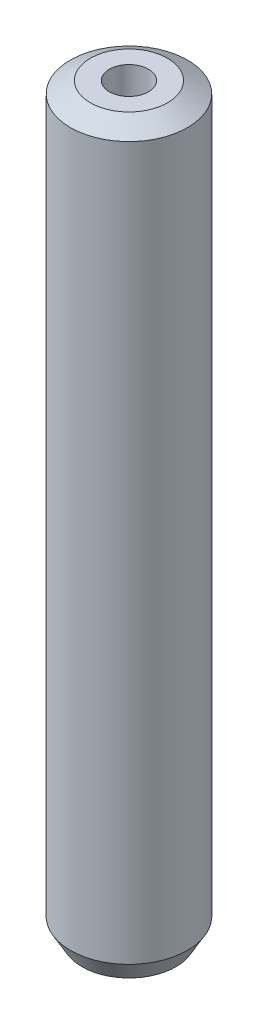
ISO-10303-21;
HEADER;
FILE_DESCRIPTION(('STEP AP214'),'2;1');
FILE_NAME('part.step','',(''),(''),'','','');
FILE_SCHEMA(('AUTOMOTIVE_DESIGN { 1 0 10303 214 1 1 1 1 }'));
ENDSEC;
DATA;
#1=APPLICATION_CONTEXT('core data for automotive mechanical design processes');
#2=APPLICATION_PROTOCOL_DEFINITION('international standard','automotive_design',2000,#1);
#3=PRODUCT_CONTEXT('',#1,'mechanical');
#4=PRODUCT('Part','Part','',(#3));
#5=PRODUCT_RELATED_PRODUCT_CATEGORY('part','',(#4));
#6=PRODUCT_DEFINITION_FORMATION('','',#4);
#7=PRODUCT_DEFINITION_CONTEXT('part definition',#1,'design');
#8=PRODUCT_DEFINITION('design','',#6,#7);
#9=PRODUCT_DEFINITION_SHAPE('','',#8);
#10=(LENGTH_UNIT() NAMED_UNIT(*) SI_UNIT(.MILLI.,.METRE.));
#11=(NAMED_UNIT(*) PLANE_ANGLE_UNIT() SI_UNIT($,.RADIAN.));
#12=(NAMED_UNIT(*) SI_UNIT($,.STERADIAN.) SOLID_ANGLE_UNIT());
#13=UNCERTAINTY_MEASURE_WITH_UNIT(LENGTH_MEASURE(1.E-05),#10,'distance_accuracy_value','');
#14=(GEOMETRIC_REPRESENTATION_CONTEXT(3) GLOBAL_UNCERTAINTY_ASSIGNED_CONTEXT((#13)) GLOBAL_UNIT_ASSIGNED_CONTEXT((#10,
#11,#12)) REPRESENTATION_CONTEXT('',''));
#15=CARTESIAN_POINT('',(0.,0.,0.));
#16=DIRECTION('',(0.,0.,1.));
#17=DIRECTION('',(1.,0.,0.));
#18=AXIS2_PLACEMENT_3D('',#15,#16,#17);
#19=CARTESIAN_POINT('',(0.,381.160073080581,0.));
#20=DIRECTION('',(0.,-1.,0.));
#21=DIRECTION('',(0.,0.,-1.));
#22=AXIS2_PLACEMENT_3D('',#19,#20,#21);
#23=CYLINDRICAL_SURFACE('',#22,30.);
#24=CARTESIAN_POINT('',(0.,375.256333196495,0.));
#25=DIRECTION('',(0.,1.,0.));
#26=DIRECTION('',(0.,0.,1.));
#27=AXIS2_PLACEMENT_3D('',#24,#25,#26);
#28=CIRCLE('',#27,30.);
#29=CARTESIAN_POINT('',(0.,375.256333196495,30.));
#30=VERTEX_POINT('',#29);
#31=EDGE_CURVE('E50',#30,#30,#28,.F.);
#32=ORIENTED_EDGE('',*,*,#31,.T.);
#33=EDGE_LOOP('',(#32));
#34=FACE_BOUND('',#33,.T.);
#35=CARTESIAN_POINT('',(0.,10.2255774339067,0.));
#36=DIRECTION('',(0.,1.,0.));
#37=DIRECTION('',(0.,0.,1.));
#38=AXIS2_PLACEMENT_3D('',#35,#36,#37);
#39=CIRCLE('',#38,30.);
#40=CARTESIAN_POINT('',(0.,10.2255774339067,30.));
#41=VERTEX_POINT('',#40);
#42=EDGE_CURVE('E51',#41,#41,#39,.T.);
#43=ORIENTED_EDGE('',*,*,#42,.T.);
#44=EDGE_LOOP('',(#43));
#45=FACE_BOUND('',#44,.T.);
#46=ADVANCED_FACE('F39',(#34,#45),#23,.T.);
#47=CARTESIAN_POINT('',(0.,381.160073080581,0.));
#48=DIRECTION('',(0.,1.,0.));
#49=DIRECTION('',(0.,0.,1.));
#50=AXIS2_PLACEMENT_3D('',#47,#48,#49);
#51=PLANE('',#50);
#52=CARTESIAN_POINT('',(0.,381.160073080581,0.));
#53=DIRECTION('',(0.,1.,0.));
#54=DIRECTION('',(0.,0.,1.));
#55=AXIS2_PLACEMENT_3D('',#52,#53,#54);
#56=CIRCLE('',#55,19.7744225660932);
#57=CARTESIAN_POINT('',(0.,381.160073080581,19.7744225660932));
#58=VERTEX_POINT('',#57);
#59=EDGE_CURVE('E54',#58,#58,#56,.T.);
#60=ORIENTED_EDGE('',*,*,#59,.T.);
#61=EDGE_LOOP('',(#60));
#62=FACE_BOUND('',#61,.T.);
#63=CARTESIAN_POINT('',(0.,381.160073080581,0.));
#64=DIRECTION('',(0.,1.,0.));
#65=DIRECTION('',(0.,0.,1.));
#66=AXIS2_PLACEMENT_3D('',#63,#64,#65);
#67=CIRCLE('',#66,10.0375877381307);
#68=CARTESIAN_POINT('',(0.,381.160073080581,10.0375877381307));
#69=VERTEX_POINT('',#68);
#70=EDGE_CURVE('E58',#69,#69,#67,.T.);
#71=ORIENTED_EDGE('',*,*,#70,.F.);
#72=EDGE_LOOP('',(#71));
#73=FACE_BOUND('',#72,.T.);
#74=ADVANCED_FACE('F69',(#62,#73),#51,.T.);
#75=CARTESIAN_POINT('',(0.,0.,0.));
#76=DIRECTION('',(0.,1.,0.));
#77=DIRECTION('',(0.,0.,1.));
#78=AXIS2_PLACEMENT_3D('',#75,#76,#77);
#79=PLANE('',#78);
#80=CARTESIAN_POINT('',(0.,0.,0.));
#81=DIRECTION('',(0.,1.,0.));
#82=DIRECTION('',(0.,0.,1.));
#83=AXIS2_PLACEMENT_3D('',#80,#81,#82);
#84=CIRCLE('',#83,24.0962601159146);
#85=CARTESIAN_POINT('',(0.,0.,24.0962601159146));
#86=VERTEX_POINT('',#85);
#87=EDGE_CURVE('E10',#86,#86,#84,.F.);
#88=ORIENTED_EDGE('',*,*,#87,.T.);
#89=EDGE_LOOP('',(#88));
#90=FACE_BOUND('',#89,.T.);
#91=CARTESIAN_POINT('',(0.,0.,0.));
#92=DIRECTION('',(0.,1.,0.));
#93=DIRECTION('',(0.,0.,1.));
#94=AXIS2_PLACEMENT_3D('',#91,#92,#93);
#95=CIRCLE('',#94,10.0375877381307);
#96=CARTESIAN_POINT('',(0.,0.,10.0375877381307));
#97=VERTEX_POINT('',#96);
#98=EDGE_CURVE('E63',#97,#97,#95,.T.);
#99=ORIENTED_EDGE('',*,*,#98,.T.);
#100=EDGE_LOOP('',(#99));
#101=FACE_BOUND('',#100,.T.);
#102=ADVANCED_FACE('F75',(#90,#101),#79,.F.);
#103=CARTESIAN_POINT('',(0.,381.160073080581,0.));
#104=DIRECTION('',(0.,-1.,0.));
#105=DIRECTION('',(0.,0.,-1.));
#106=AXIS2_PLACEMENT_3D('',#103,#104,#105);
#107=CYLINDRICAL_SURFACE('',#106,10.0375877381307);
#108=ORIENTED_EDGE('',*,*,#70,.T.);
#109=EDGE_LOOP('',(#108));
#110=FACE_BOUND('',#109,.T.);
#111=ORIENTED_EDGE('',*,*,#98,.F.);
#112=EDGE_LOOP('',(#111));
#113=FACE_BOUND('',#112,.T.);
#114=ADVANCED_FACE('F70',(#110,#113),#107,.F.);
#115=CARTESIAN_POINT('',(0.,381.160073080581,0.));
#116=DIRECTION('',(0.,-1.,0.));
#117=DIRECTION('',(0.,0.,-1.));
#118=AXIS2_PLACEMENT_3D('',#115,#116,#117);
#119=CONICAL_SURFACE('',#118,19.7744225660932,1.04719755119659);
#120=ORIENTED_EDGE('',*,*,#31,.F.);
#121=EDGE_LOOP('',(#120));
#122=FACE_BOUND('',#121,.T.);
#123=ORIENTED_EDGE('',*,*,#59,.F.);
#124=EDGE_LOOP('',(#123));
#125=FACE_BOUND('',#124,.T.);
#126=ADVANCED_FACE('F81',(#122,#125),#119,.T.);
#127=CARTESIAN_POINT('',(0.,10.2255774339067,0.));
#128=DIRECTION('',(0.,1.,0.));
#129=DIRECTION('',(0.,0.,1.));
#130=AXIS2_PLACEMENT_3D('',#127,#128,#129);
#131=CONICAL_SURFACE('',#130,30.,0.523598775598301);
#132=ORIENTED_EDGE('',*,*,#87,.F.);
#133=EDGE_LOOP('',(#132));
#134=FACE_BOUND('',#133,.T.);
#135=ORIENTED_EDGE('',*,*,#42,.F.);
#136=EDGE_LOOP('',(#135));
#137=FACE_BOUND('',#136,.T.);
#138=ADVANCED_FACE('F45',(#134,#137),#131,.T.);
#139=CLOSED_SHELL('',(#46,#74,#102,#114,#126,#138));
#140=MANIFOLD_SOLID_BREP('B2',#139);
#141=ADVANCED_BREP_SHAPE_REPRESENTATION('',(#18,#140),#14);
#142=SHAPE_DEFINITION_REPRESENTATION(#9,#141);
ENDSEC;
END-ISO-10303-21;
